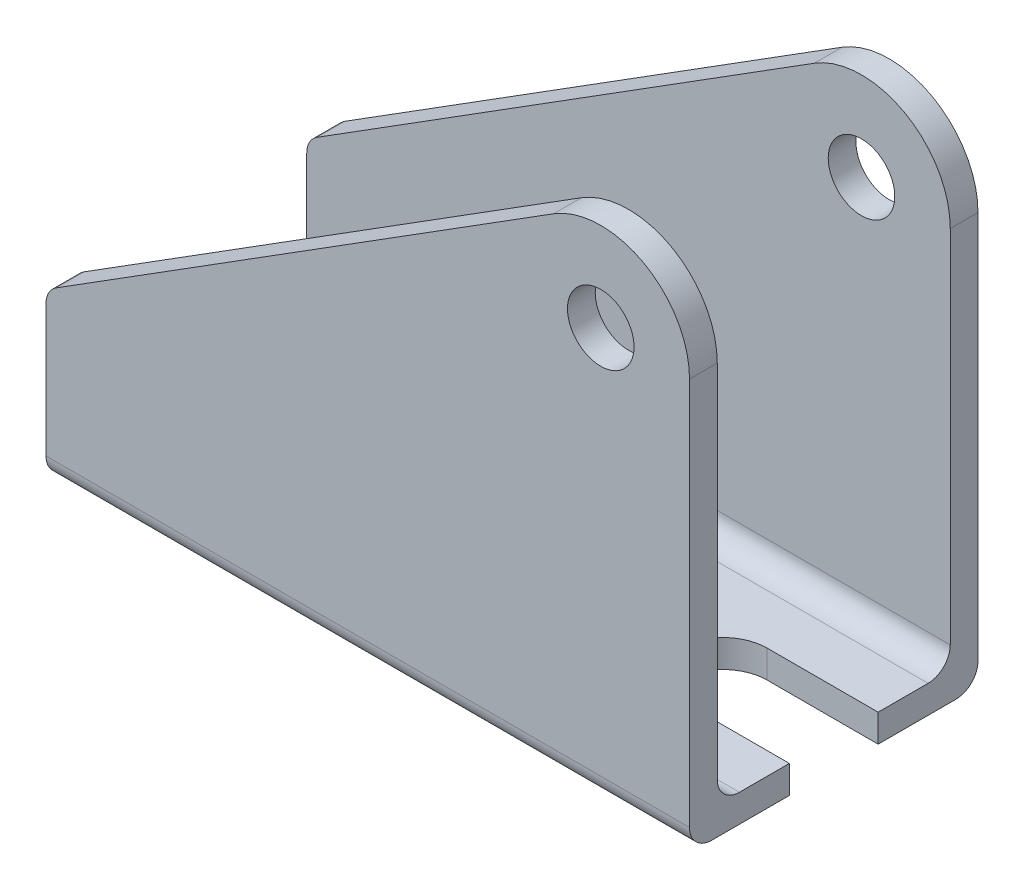
ISO-10303-21;
HEADER;
FILE_DESCRIPTION(('STEP AP214'),'2;1');
FILE_NAME('part.step','',(''),(''),'','','');
FILE_SCHEMA(('AUTOMOTIVE_DESIGN { 1 0 10303 214 1 1 1 1 }'));
ENDSEC;
DATA;
#1=APPLICATION_CONTEXT('core data for automotive mechanical design processes');
#2=APPLICATION_PROTOCOL_DEFINITION('international standard','automotive_design',2000,#1);
#3=PRODUCT_CONTEXT('',#1,'mechanical');
#4=PRODUCT('Part','Part','',(#3));
#5=PRODUCT_RELATED_PRODUCT_CATEGORY('part','',(#4));
#6=PRODUCT_DEFINITION_FORMATION('','',#4);
#7=PRODUCT_DEFINITION_CONTEXT('part definition',#1,'design');
#8=PRODUCT_DEFINITION('design','',#6,#7);
#9=PRODUCT_DEFINITION_SHAPE('','',#8);
#10=(LENGTH_UNIT() NAMED_UNIT(*) SI_UNIT(.MILLI.,.METRE.));
#11=(NAMED_UNIT(*) PLANE_ANGLE_UNIT() SI_UNIT($,.RADIAN.));
#12=(NAMED_UNIT(*) SI_UNIT($,.STERADIAN.) SOLID_ANGLE_UNIT());
#13=UNCERTAINTY_MEASURE_WITH_UNIT(LENGTH_MEASURE(1.E-05),#10,'distance_accuracy_value','');
#14=(GEOMETRIC_REPRESENTATION_CONTEXT(3) GLOBAL_UNCERTAINTY_ASSIGNED_CONTEXT((#13)) GLOBAL_UNIT_ASSIGNED_CONTEXT((#10,
#11,#12)) REPRESENTATION_CONTEXT('',''));
#15=CARTESIAN_POINT('',(0.,0.,0.));
#16=DIRECTION('',(0.,0.,1.));
#17=DIRECTION('',(1.,0.,0.));
#18=AXIS2_PLACEMENT_3D('',#15,#16,#17);
#19=CARTESIAN_POINT('',(37.3748426105827,-9.78031656853013,26.));
#20=DIRECTION('',(-1.,0.,0.));
#21=DIRECTION('',(0.,0.,1.));
#22=AXIS2_PLACEMENT_3D('',#19,#20,#21);
#23=PLANE('',#22);
#24=DIRECTION('',(0.,0.,-1.));
#25=VECTOR('',#24,1.);
#26=CARTESIAN_POINT('',(37.3748426105827,-9.78031656853013,26.));
#27=LINE('',#26,#25);
#28=CARTESIAN_POINT('',(37.3748426105827,-9.78031656853013,24.));
#29=VERTEX_POINT('',#28);
#30=CARTESIAN_POINT('',(37.3748426105827,-9.78031656853013,17.));
#31=VERTEX_POINT('',#30);
#32=EDGE_CURVE('E206',#29,#31,#27,.T.);
#33=ORIENTED_EDGE('',*,*,#32,.T.);
#34=DIRECTION('',(0.,1.,0.));
#35=VECTOR('',#34,1.);
#36=CARTESIAN_POINT('',(37.3748426105827,-9.78031656853013,17.));
#37=LINE('',#36,#35);
#38=CARTESIAN_POINT('',(37.3748426105827,-7.28031656853013,17.));
#39=VERTEX_POINT('',#38);
#40=EDGE_CURVE('E317',#31,#39,#37,.T.);
#41=ORIENTED_EDGE('',*,*,#40,.T.);
#42=DIRECTION('',(0.,0.,-1.));
#43=VECTOR('',#42,1.);
#44=CARTESIAN_POINT('',(37.3748426105827,-7.28031656853013,26.));
#45=LINE('',#44,#43);
#46=CARTESIAN_POINT('',(37.3748426105827,-7.28031656853013,21.5));
#47=VERTEX_POINT('',#46);
#48=EDGE_CURVE('E323',#47,#39,#45,.T.);
#49=ORIENTED_EDGE('',*,*,#48,.F.);
#50=CARTESIAN_POINT('',(37.3748426105827,-5.28031656853013,21.5));
#51=DIRECTION('',(-1.,0.,0.));
#52=DIRECTION('',(0.,0.,1.));
#53=AXIS2_PLACEMENT_3D('',#50,#51,#52);
#54=CIRCLE('',#53,2.);
#55=CARTESIAN_POINT('',(37.3748426105827,-5.28031656853014,23.5));
#56=VERTEX_POINT('',#55);
#57=EDGE_CURVE('E283',#47,#56,#54,.T.);
#58=ORIENTED_EDGE('',*,*,#57,.T.);
#59=DIRECTION('',(0.,1.,0.));
#60=VECTOR('',#59,1.);
#61=CARTESIAN_POINT('',(37.3748426105827,27.2196834314699,23.5));
#62=LINE('',#61,#60);
#63=CARTESIAN_POINT('',(37.3748426105827,27.2196834314699,23.5));
#64=VERTEX_POINT('',#63);
#65=EDGE_CURVE('E338',#56,#64,#62,.T.);
#66=ORIENTED_EDGE('',*,*,#65,.T.);
#67=DIRECTION('',(0.,0.,-1.));
#68=VECTOR('',#67,1.);
#69=CARTESIAN_POINT('',(37.3748426105827,27.2196834314699,26.));
#70=LINE('',#69,#68);
#71=CARTESIAN_POINT('',(37.3748426105827,27.2196834314699,26.));
#72=VERTEX_POINT('',#71);
#73=EDGE_CURVE('E207',#72,#64,#70,.T.);
#74=ORIENTED_EDGE('',*,*,#73,.F.);
#75=DIRECTION('',(0.,1.,0.));
#76=VECTOR('',#75,1.);
#77=CARTESIAN_POINT('',(37.3748426105827,-9.78031656853013,26.));
#78=LINE('',#77,#76);
#79=CARTESIAN_POINT('',(37.3748426105827,-7.78031656853013,26.));
#80=VERTEX_POINT('',#79);
#81=EDGE_CURVE('E373',#80,#72,#78,.T.);
#82=ORIENTED_EDGE('',*,*,#81,.F.);
#83=CARTESIAN_POINT('',(37.3748426105827,-7.78031656853013,24.));
#84=DIRECTION('',(-1.,0.,0.));
#85=DIRECTION('',(0.,0.,1.));
#86=AXIS2_PLACEMENT_3D('',#83,#84,#85);
#87=CIRCLE('',#86,2.);
#88=EDGE_CURVE('E230',#80,#29,#87,.F.);
#89=ORIENTED_EDGE('',*,*,#88,.T.);
#90=EDGE_LOOP('',(#33,#41,#49,#58,#66,#74,#82,#89));
#91=FACE_BOUND('',#90,.T.);
#92=ADVANCED_FACE('F42',(#91),#23,.F.);
#93=CARTESIAN_POINT('',(-20.6251573894173,5.21968343146987,26.));
#94=DIRECTION('',(1.,0.,0.));
#95=DIRECTION('',(0.,1.,0.));
#96=AXIS2_PLACEMENT_3D('',#93,#94,#95);
#97=PLANE('',#96);
#98=DIRECTION('',(0.,0.,-1.));
#99=VECTOR('',#98,1.);
#100=CARTESIAN_POINT('',(-20.6251573894173,-9.78031656853013,26.));
#101=LINE('',#100,#99);
#102=CARTESIAN_POINT('',(-20.6251573894173,-9.78031656853013,24.));
#103=VERTEX_POINT('',#102);
#104=CARTESIAN_POINT('',(-20.6251573894173,-9.78031656853013,2.00000000000001));
#105=VERTEX_POINT('',#104);
#106=EDGE_CURVE('E212',#103,#105,#101,.T.);
#107=ORIENTED_EDGE('',*,*,#106,.F.);
#108=CARTESIAN_POINT('',(-20.6251573894173,-7.78031656853013,24.));
#109=DIRECTION('',(1.,0.,0.));
#110=DIRECTION('',(0.,1.,0.));
#111=AXIS2_PLACEMENT_3D('',#108,#109,#110);
#112=CIRCLE('',#111,2.);
#113=CARTESIAN_POINT('',(-20.6251573894173,-7.78031656853013,26.));
#114=VERTEX_POINT('',#113);
#115=EDGE_CURVE('E249',#103,#114,#112,.F.);
#116=ORIENTED_EDGE('',*,*,#115,.T.);
#117=DIRECTION('',(0.,-1.,0.));
#118=VECTOR('',#117,1.);
#119=CARTESIAN_POINT('',(-20.6251573894173,5.21968343146987,26.));
#120=LINE('',#119,#118);
#121=CARTESIAN_POINT('',(-20.6251573894173,4.1149584540759,26.));
#122=VERTEX_POINT('',#121);
#123=EDGE_CURVE('E369',#122,#114,#120,.T.);
#124=ORIENTED_EDGE('',*,*,#123,.F.);
#125=DIRECTION('',(0.,0.,-1.));
#126=VECTOR('',#125,1.);
#127=CARTESIAN_POINT('',(-20.6251573894173,4.1149584540759,26.));
#128=LINE('',#127,#126);
#129=CARTESIAN_POINT('',(-20.6251573894173,4.1149584540759,23.5));
#130=VERTEX_POINT('',#129);
#131=EDGE_CURVE('E242',#122,#130,#128,.T.);
#132=ORIENTED_EDGE('',*,*,#131,.T.);
#133=DIRECTION('',(0.,-1.,0.));
#134=VECTOR('',#133,1.);
#135=CARTESIAN_POINT('',(-20.6251573894173,27.2196834314699,23.5));
#136=LINE('',#135,#134);
#137=CARTESIAN_POINT('',(-20.6251573894173,-5.28031656853013,23.5));
#138=VERTEX_POINT('',#137);
#139=EDGE_CURVE('E350',#130,#138,#136,.T.);
#140=ORIENTED_EDGE('',*,*,#139,.T.);
#141=CARTESIAN_POINT('',(-20.6251573894173,-5.28031656853013,21.5));
#142=DIRECTION('',(1.,0.,0.));
#143=DIRECTION('',(0.,1.,0.));
#144=AXIS2_PLACEMENT_3D('',#141,#142,#143);
#145=CIRCLE('',#144,2.);
#146=CARTESIAN_POINT('',(-20.6251573894173,-7.28031656853013,21.5));
#147=VERTEX_POINT('',#146);
#148=EDGE_CURVE('E286',#138,#147,#145,.T.);
#149=ORIENTED_EDGE('',*,*,#148,.T.);
#150=DIRECTION('',(0.,0.,-1.));
#151=VECTOR('',#150,1.);
#152=CARTESIAN_POINT('',(-20.6251573894173,-7.28031656853013,26.));
#153=LINE('',#152,#151);
#154=CARTESIAN_POINT('',(-20.6251573894173,-7.28031656853013,4.5));
#155=VERTEX_POINT('',#154);
#156=EDGE_CURVE('E328',#147,#155,#153,.T.);
#157=ORIENTED_EDGE('',*,*,#156,.T.);
#158=CARTESIAN_POINT('',(-20.6251573894173,-5.28031656853014,4.5));
#159=DIRECTION('',(1.,0.,0.));
#160=DIRECTION('',(0.,1.,0.));
#161=AXIS2_PLACEMENT_3D('',#158,#159,#160);
#162=CIRCLE('',#161,2.);
#163=CARTESIAN_POINT('',(-20.6251573894173,-5.28031656853013,2.5));
#164=VERTEX_POINT('',#163);
#165=EDGE_CURVE('E292',#155,#164,#162,.T.);
#166=ORIENTED_EDGE('',*,*,#165,.T.);
#167=DIRECTION('',(0.,-1.,0.));
#168=VECTOR('',#167,1.);
#169=CARTESIAN_POINT('',(-20.6251573894173,27.2196834314699,2.5));
#170=LINE('',#169,#168);
#171=CARTESIAN_POINT('',(-20.6251573894173,4.1149584540759,2.5));
#172=VERTEX_POINT('',#171);
#173=EDGE_CURVE('E344',#172,#164,#170,.T.);
#174=ORIENTED_EDGE('',*,*,#173,.F.);
#175=DIRECTION('',(0.,0.,-1.));
#176=VECTOR('',#175,1.);
#177=CARTESIAN_POINT('',(-20.6251573894173,4.1149584540759,26.));
#178=LINE('',#177,#176);
#179=CARTESIAN_POINT('',(-20.6251573894173,4.1149584540759,0.));
#180=VERTEX_POINT('',#179);
#181=EDGE_CURVE('E238',#172,#180,#178,.T.);
#182=ORIENTED_EDGE('',*,*,#181,.T.);
#183=DIRECTION('',(0.,-1.,0.));
#184=VECTOR('',#183,1.);
#185=CARTESIAN_POINT('',(-20.6251573894173,5.21968343146987,0.));
#186=LINE('',#185,#184);
#187=CARTESIAN_POINT('',(-20.6251573894173,-7.78031656853013,0.));
#188=VERTEX_POINT('',#187);
#189=EDGE_CURVE('E365',#180,#188,#186,.T.);
#190=ORIENTED_EDGE('',*,*,#189,.T.);
#191=CARTESIAN_POINT('',(-20.6251573894173,-7.78031656853013,2.));
#192=DIRECTION('',(1.,0.,0.));
#193=DIRECTION('',(0.,1.,0.));
#194=AXIS2_PLACEMENT_3D('',#191,#192,#193);
#195=CIRCLE('',#194,2.);
#196=EDGE_CURVE('E246',#188,#105,#195,.F.);
#197=ORIENTED_EDGE('',*,*,#196,.T.);
#198=EDGE_LOOP('',(#107,#116,#124,#132,#140,#149,#157,#166,#174,#182,#190,#197));
#199=FACE_BOUND('',#198,.T.);
#200=ADVANCED_FACE('F426',(#199),#97,.F.);
#201=CARTESIAN_POINT('',(37.3748426105827,-7.28031656853013,8.99999999999999));
#202=VERTEX_POINT('',#201);
#203=CARTESIAN_POINT('',(37.3748426105827,-7.28031656853013,4.5));
#204=VERTEX_POINT('',#203);
#205=EDGE_CURVE('E196',#202,#204,#45,.T.);
#206=ORIENTED_EDGE('',*,*,#205,.F.);
#207=DIRECTION('',(0.,1.,0.));
#208=VECTOR('',#207,1.);
#209=CARTESIAN_POINT('',(37.3748426105827,-9.78031656853013,8.99999999999999));
#210=LINE('',#209,#208);
#211=CARTESIAN_POINT('',(37.3748426105827,-9.78031656853013,8.99999999999999));
#212=VERTEX_POINT('',#211);
#213=EDGE_CURVE('E58',#212,#202,#210,.T.);
#214=ORIENTED_EDGE('',*,*,#213,.F.);
#215=CARTESIAN_POINT('',(37.3748426105827,-9.78031656853013,2.00000000000001));
#216=VERTEX_POINT('',#215);
#217=EDGE_CURVE('E193',#212,#216,#27,.T.);
#218=ORIENTED_EDGE('',*,*,#217,.T.);
#219=CARTESIAN_POINT('',(37.3748426105827,-7.78031656853013,2.));
#220=DIRECTION('',(-1.,0.,0.));
#221=DIRECTION('',(0.,0.,1.));
#222=AXIS2_PLACEMENT_3D('',#219,#220,#221);
#223=CIRCLE('',#222,2.);
#224=CARTESIAN_POINT('',(37.3748426105827,-7.78031656853013,0.));
#225=VERTEX_POINT('',#224);
#226=EDGE_CURVE('E227',#216,#225,#223,.F.);
#227=ORIENTED_EDGE('',*,*,#226,.T.);
#228=DIRECTION('',(0.,1.,0.));
#229=VECTOR('',#228,1.);
#230=CARTESIAN_POINT('',(37.3748426105827,-9.78031656853013,0.));
#231=LINE('',#230,#229);
#232=CARTESIAN_POINT('',(37.3748426105827,27.2196834314699,0.));
#233=VERTEX_POINT('',#232);
#234=EDGE_CURVE('E388',#225,#233,#231,.T.);
#235=ORIENTED_EDGE('',*,*,#234,.T.);
#236=CARTESIAN_POINT('',(37.3748426105827,27.2196834314699,2.5));
#237=VERTEX_POINT('',#236);
#238=EDGE_CURVE('E214',#237,#233,#70,.T.);
#239=ORIENTED_EDGE('',*,*,#238,.F.);
#240=DIRECTION('',(0.,1.,0.));
#241=VECTOR('',#240,1.);
#242=CARTESIAN_POINT('',(37.3748426105827,27.2196834314699,2.5));
#243=LINE('',#242,#241);
#244=CARTESIAN_POINT('',(37.3748426105827,-5.28031656853014,2.5));
#245=VERTEX_POINT('',#244);
#246=EDGE_CURVE('E340',#245,#237,#243,.T.);
#247=ORIENTED_EDGE('',*,*,#246,.F.);
#248=CARTESIAN_POINT('',(37.3748426105827,-5.28031656853014,4.5));
#249=DIRECTION('',(-1.,0.,0.));
#250=DIRECTION('',(0.,0.,1.));
#251=AXIS2_PLACEMENT_3D('',#248,#249,#250);
#252=CIRCLE('',#251,2.);
#253=EDGE_CURVE('E289',#245,#204,#252,.T.);
#254=ORIENTED_EDGE('',*,*,#253,.T.);
#255=EDGE_LOOP('',(#206,#214,#218,#227,#235,#239,#247,#254));
#256=FACE_BOUND('',#255,.T.);
#257=ADVANCED_FACE('F192',(#256),#23,.F.);
#258=CARTESIAN_POINT('',(29.3748426105827,27.2196834314699,26.));
#259=DIRECTION('',(0.,0.,-1.));
#260=DIRECTION('',(-1.,0.,0.));
#261=AXIS2_PLACEMENT_3D('',#258,#259,#260);
#262=CYLINDRICAL_SURFACE('',#261,8.);
#263=CARTESIAN_POINT('',(29.3748426105827,27.2196834314699,2.5));
#264=DIRECTION('',(0.,0.,-1.));
#265=DIRECTION('',(-1.,0.,0.));
#266=AXIS2_PLACEMENT_3D('',#263,#264,#265);
#267=CIRCLE('',#266,8.);
#268=CARTESIAN_POINT('',(25.115286214933,33.991402512492,2.5));
#269=VERTEX_POINT('',#268);
#270=EDGE_CURVE('E343',#237,#269,#267,.F.);
#271=ORIENTED_EDGE('',*,*,#270,.F.);
#272=ORIENTED_EDGE('',*,*,#238,.T.);
#273=CARTESIAN_POINT('',(29.3748426105827,27.2196834314699,0.));
#274=DIRECTION('',(0.,0.,1.));
#275=DIRECTION('',(-1.,0.,0.));
#276=AXIS2_PLACEMENT_3D('',#273,#274,#275);
#277=CIRCLE('',#276,8.);
#278=CARTESIAN_POINT('',(25.115286214933,33.991402512492,0.));
#279=VERTEX_POINT('',#278);
#280=EDGE_CURVE('E391',#233,#279,#277,.T.);
#281=ORIENTED_EDGE('',*,*,#280,.T.);
#282=DIRECTION('',(0.,0.,-1.));
#283=VECTOR('',#282,1.);
#284=CARTESIAN_POINT('',(25.115286214933,33.991402512492,26.));
#285=LINE('',#284,#283);
#286=EDGE_CURVE('E384',#269,#279,#285,.T.);
#287=ORIENTED_EDGE('',*,*,#286,.F.);
#288=EDGE_LOOP('',(#271,#272,#281,#287));
#289=FACE_BOUND('',#288,.T.);
#290=ADVANCED_FACE('F412',(#289),#262,.T.);
#291=CARTESIAN_POINT('',(25.115286214933,33.991402512492,26.));
#292=DIRECTION('',(0.532444549456218,-0.846464885127768,0.));
#293=DIRECTION('',(0.846464885127768,0.532444549456218,0.));
#294=AXIS2_PLACEMENT_3D('',#291,#292,#293);
#295=PLANE('',#294);
#296=DIRECTION('',(-0.846464885127768,-0.532444549456218,0.));
#297=VECTOR('',#296,1.);
#298=CARTESIAN_POINT('',(25.115286214933,33.991402512492,0.));
#299=LINE('',#298,#297);
#300=CARTESIAN_POINT('',(-19.6900464883297,5.80788822433143,0.));
#301=VERTEX_POINT('',#300);
#302=EDGE_CURVE('E374',#279,#301,#299,.T.);
#303=ORIENTED_EDGE('',*,*,#302,.T.);
#304=DIRECTION('',(0.,0.,-1.));
#305=VECTOR('',#304,1.);
#306=CARTESIAN_POINT('',(-19.6900464883297,5.80788822433143,26.));
#307=LINE('',#306,#305);
#308=CARTESIAN_POINT('',(-19.6900464883297,5.80788822433143,2.5));
#309=VERTEX_POINT('',#308);
#310=EDGE_CURVE('E66',#301,#309,#307,.F.);
#311=ORIENTED_EDGE('',*,*,#310,.T.);
#312=DIRECTION('',(-0.846464885127768,-0.532444549456218,0.));
#313=VECTOR('',#312,1.);
#314=CARTESIAN_POINT('',(25.115286214933,33.991402512492,2.5));
#315=LINE('',#314,#313);
#316=EDGE_CURVE('E347',#269,#309,#315,.T.);
#317=ORIENTED_EDGE('',*,*,#316,.F.);
#318=ORIENTED_EDGE('',*,*,#286,.T.);
#319=EDGE_LOOP('',(#303,#311,#317,#318));
#320=FACE_BOUND('',#319,.T.);
#321=ADVANCED_FACE('F407',(#320),#295,.F.);
#322=CARTESIAN_POINT('',(29.3748426105827,27.2196834314699,26.));
#323=DIRECTION('',(0.,0.,-1.));
#324=DIRECTION('',(-1.,0.,0.));
#325=AXIS2_PLACEMENT_3D('',#322,#323,#324);
#326=CYLINDRICAL_SURFACE('',#325,3.);
#327=CARTESIAN_POINT('',(29.3748426105827,27.2196834314699,0.));
#328=DIRECTION('',(0.,0.,1.));
#329=DIRECTION('',(1.,0.,0.));
#330=AXIS2_PLACEMENT_3D('',#327,#328,#329);
#331=CIRCLE('',#330,3.);
#332=CARTESIAN_POINT('',(32.3748426105827,27.2196834314699,0.));
#333=VERTEX_POINT('',#332);
#334=EDGE_CURVE('E333',#333,#333,#331,.T.);
#335=ORIENTED_EDGE('',*,*,#334,.F.);
#336=EDGE_LOOP('',(#335));
#337=FACE_BOUND('',#336,.T.);
#338=CARTESIAN_POINT('',(29.3748426105827,27.2196834314699,2.5));
#339=DIRECTION('',(0.,0.,-1.));
#340=DIRECTION('',(-1.,0.,0.));
#341=AXIS2_PLACEMENT_3D('',#338,#339,#340);
#342=CIRCLE('',#341,3.);
#343=CARTESIAN_POINT('',(26.3748426105827,27.2196834314699,2.5));
#344=VERTEX_POINT('',#343);
#345=EDGE_CURVE('E300',#344,#344,#342,.F.);
#346=ORIENTED_EDGE('',*,*,#345,.T.);
#347=EDGE_LOOP('',(#346));
#348=FACE_BOUND('',#347,.T.);
#349=ADVANCED_FACE('F487',(#337,#348),#326,.F.);
#350=CARTESIAN_POINT('',(29.3748426105827,27.2196834314699,26.));
#351=DIRECTION('',(0.,0.,-1.));
#352=DIRECTION('',(-1.,0.,0.));
#353=AXIS2_PLACEMENT_3D('',#350,#351,#352);
#354=PLANE('',#353);
#355=ORIENTED_EDGE('',*,*,#123,.T.);
#356=DIRECTION('',(1.,0.,0.));
#357=VECTOR('',#356,1.);
#358=CARTESIAN_POINT('',(29.3748426105827,-7.78031656853013,26.));
#359=LINE('',#358,#357);
#360=EDGE_CURVE('E223',#114,#80,#359,.T.);
#361=ORIENTED_EDGE('',*,*,#360,.T.);
#362=ORIENTED_EDGE('',*,*,#81,.T.);
#363=CARTESIAN_POINT('',(29.3748426105827,27.2196834314699,26.));
#364=DIRECTION('',(0.,0.,1.));
#365=DIRECTION('',(-1.,0.,0.));
#366=AXIS2_PLACEMENT_3D('',#363,#364,#365);
#367=CIRCLE('',#366,8.);
#368=CARTESIAN_POINT('',(25.115286214933,33.991402512492,26.));
#369=VERTEX_POINT('',#368);
#370=EDGE_CURVE('E377',#72,#369,#367,.T.);
#371=ORIENTED_EDGE('',*,*,#370,.T.);
#372=DIRECTION('',(-0.846464885127768,-0.532444549456218,0.));
#373=VECTOR('',#372,1.);
#374=CARTESIAN_POINT('',(25.115286214933,33.991402512492,26.));
#375=LINE('',#374,#373);
#376=CARTESIAN_POINT('',(-19.6900464883297,5.80788822433143,26.));
#377=VERTEX_POINT('',#376);
#378=EDGE_CURVE('E380',#369,#377,#375,.T.);
#379=ORIENTED_EDGE('',*,*,#378,.T.);
#380=CARTESIAN_POINT('',(-18.6251573894173,4.1149584540759,26.));
#381=DIRECTION('',(0.,0.,-1.));
#382=DIRECTION('',(-1.,0.,0.));
#383=AXIS2_PLACEMENT_3D('',#380,#381,#382);
#384=CIRCLE('',#383,2.);
#385=EDGE_CURVE('E220',#377,#122,#384,.F.);
#386=ORIENTED_EDGE('',*,*,#385,.T.);
#387=EDGE_LOOP('',(#355,#361,#362,#371,#379,#386));
#388=FACE_BOUND('',#387,.T.);
#389=CARTESIAN_POINT('',(29.3748426105827,27.2196834314699,26.));
#390=DIRECTION('',(0.,0.,1.));
#391=DIRECTION('',(1.,0.,0.));
#392=AXIS2_PLACEMENT_3D('',#389,#390,#391);
#393=CIRCLE('',#392,3.);
#394=CARTESIAN_POINT('',(32.3748426105827,27.2196834314699,26.));
#395=VERTEX_POINT('',#394);
#396=EDGE_CURVE('E361',#395,#395,#393,.T.);
#397=ORIENTED_EDGE('',*,*,#396,.F.);
#398=EDGE_LOOP('',(#397));
#399=FACE_BOUND('',#398,.T.);
#400=ADVANCED_FACE('F448',(#388,#399),#354,.F.);
#401=CARTESIAN_POINT('',(29.3748426105827,27.2196834314699,0.));
#402=DIRECTION('',(0.,0.,-1.));
#403=DIRECTION('',(-1.,0.,0.));
#404=AXIS2_PLACEMENT_3D('',#401,#402,#403);
#405=PLANE('',#404);
#406=ORIENTED_EDGE('',*,*,#234,.F.);
#407=DIRECTION('',(1.,0.,0.));
#408=VECTOR('',#407,1.);
#409=CARTESIAN_POINT('',(-20.6251573894173,-7.78031656853013,0.));
#410=LINE('',#409,#408);
#411=EDGE_CURVE('E255',#225,#188,#410,.F.);
#412=ORIENTED_EDGE('',*,*,#411,.T.);
#413=ORIENTED_EDGE('',*,*,#189,.F.);
#414=CARTESIAN_POINT('',(-18.6251573894173,4.1149584540759,0.));
#415=DIRECTION('',(0.,0.,-1.));
#416=DIRECTION('',(-1.,0.,0.));
#417=AXIS2_PLACEMENT_3D('',#414,#415,#416);
#418=CIRCLE('',#417,2.);
#419=EDGE_CURVE('E252',#180,#301,#418,.T.);
#420=ORIENTED_EDGE('',*,*,#419,.T.);
#421=ORIENTED_EDGE('',*,*,#302,.F.);
#422=ORIENTED_EDGE('',*,*,#280,.F.);
#423=EDGE_LOOP('',(#406,#412,#413,#420,#421,#422));
#424=FACE_BOUND('',#423,.T.);
#425=ORIENTED_EDGE('',*,*,#334,.T.);
#426=EDGE_LOOP('',(#425));
#427=FACE_BOUND('',#426,.T.);
#428=ADVANCED_FACE('F416',(#424,#427),#405,.T.);
#429=CARTESIAN_POINT('',(-20.6251573894173,-9.78031656853013,26.));
#430=DIRECTION('',(0.,1.,0.));
#431=DIRECTION('',(0.,0.,1.));
#432=AXIS2_PLACEMENT_3D('',#429,#430,#431);
#433=PLANE('',#432);
#434=CARTESIAN_POINT('',(-8.62515738941729,-9.78031656853013,13.));
#435=DIRECTION('',(0.,1.,0.));
#436=DIRECTION('',(0.,0.,1.));
#437=AXIS2_PLACEMENT_3D('',#434,#435,#436);
#438=CIRCLE('',#437,4.);
#439=CARTESIAN_POINT('',(-8.62515738941729,-9.78031656853013,17.));
#440=VERTEX_POINT('',#439);
#441=EDGE_CURVE('E301',#440,#440,#438,.T.);
#442=ORIENTED_EDGE('',*,*,#441,.T.);
#443=EDGE_LOOP('',(#442));
#444=FACE_BOUND('',#443,.T.);
#445=CARTESIAN_POINT('',(27.3748426105827,-9.78031656853013,13.));
#446=DIRECTION('',(0.,1.,0.));
#447=DIRECTION('',(0.,0.,1.));
#448=AXIS2_PLACEMENT_3D('',#445,#446,#447);
#449=CIRCLE('',#448,4.);
#450=CARTESIAN_POINT('',(27.3748426105827,-9.78031656853013,8.99999999999999));
#451=VERTEX_POINT('',#450);
#452=CARTESIAN_POINT('',(27.3748426105827,-9.78031656853013,17.));
#453=VERTEX_POINT('',#452);
#454=EDGE_CURVE('E188',#451,#453,#449,.T.);
#455=ORIENTED_EDGE('',*,*,#454,.T.);
#456=DIRECTION('',(1.,0.,0.));
#457=VECTOR('',#456,1.);
#458=CARTESIAN_POINT('',(27.3748426105827,-9.78031656853013,17.));
#459=LINE('',#458,#457);
#460=EDGE_CURVE('E198',#453,#31,#459,.T.);
#461=ORIENTED_EDGE('',*,*,#460,.T.);
#462=ORIENTED_EDGE('',*,*,#32,.F.);
#463=DIRECTION('',(1.,0.,0.));
#464=VECTOR('',#463,1.);
#465=CARTESIAN_POINT('',(-20.6251573894173,-9.78031656853013,24.));
#466=LINE('',#465,#464);
#467=EDGE_CURVE('E235',#29,#103,#466,.F.);
#468=ORIENTED_EDGE('',*,*,#467,.T.);
#469=ORIENTED_EDGE('',*,*,#106,.T.);
#470=DIRECTION('',(1.,0.,0.));
#471=VECTOR('',#470,1.);
#472=CARTESIAN_POINT('',(37.3748426105827,-9.78031656853013,2.));
#473=LINE('',#472,#471);
#474=EDGE_CURVE('E204',#105,#216,#473,.T.);
#475=ORIENTED_EDGE('',*,*,#474,.T.);
#476=ORIENTED_EDGE('',*,*,#217,.F.);
#477=DIRECTION('',(-1.,0.,0.));
#478=VECTOR('',#477,1.);
#479=CARTESIAN_POINT('',(37.3748426105827,-9.78031656853013,8.99999999999999));
#480=LINE('',#479,#478);
#481=EDGE_CURVE('E179',#212,#451,#480,.T.);
#482=ORIENTED_EDGE('',*,*,#481,.T.);
#483=EDGE_LOOP('',(#455,#461,#462,#468,#469,#475,#476,#482));
#484=FACE_BOUND('',#483,.T.);
#485=ADVANCED_FACE('F201',(#444,#484),#433,.F.);
#486=ORIENTED_EDGE('',*,*,#73,.T.);
#487=CARTESIAN_POINT('',(29.3748426105827,27.2196834314699,23.5));
#488=DIRECTION('',(0.,0.,-1.));
#489=DIRECTION('',(-1.,0.,0.));
#490=AXIS2_PLACEMENT_3D('',#487,#488,#489);
#491=CIRCLE('',#490,8.);
#492=CARTESIAN_POINT('',(25.115286214933,33.991402512492,23.5));
#493=VERTEX_POINT('',#492);
#494=EDGE_CURVE('E466',#64,#493,#491,.F.);
#495=ORIENTED_EDGE('',*,*,#494,.T.);
#496=EDGE_CURVE('E396',#369,#493,#285,.T.);
#497=ORIENTED_EDGE('',*,*,#496,.F.);
#498=ORIENTED_EDGE('',*,*,#370,.F.);
#499=EDGE_LOOP('',(#486,#495,#497,#498));
#500=FACE_BOUND('',#499,.T.);
#501=ADVANCED_FACE('F474',(#500),#262,.T.);
#502=DIRECTION('',(-0.846464885127768,-0.532444549456218,0.));
#503=VECTOR('',#502,1.);
#504=CARTESIAN_POINT('',(25.115286214933,33.991402512492,23.5));
#505=LINE('',#504,#503);
#506=CARTESIAN_POINT('',(-19.6900464883297,5.80788822433143,23.5));
#507=VERTEX_POINT('',#506);
#508=EDGE_CURVE('E335',#493,#507,#505,.T.);
#509=ORIENTED_EDGE('',*,*,#508,.T.);
#510=DIRECTION('',(0.,0.,-1.));
#511=VECTOR('',#510,1.);
#512=CARTESIAN_POINT('',(-19.6900464883297,5.80788822433143,26.));
#513=LINE('',#512,#511);
#514=EDGE_CURVE('E264',#507,#377,#513,.F.);
#515=ORIENTED_EDGE('',*,*,#514,.T.);
#516=ORIENTED_EDGE('',*,*,#378,.F.);
#517=ORIENTED_EDGE('',*,*,#496,.T.);
#518=EDGE_LOOP('',(#509,#515,#516,#517));
#519=FACE_BOUND('',#518,.T.);
#520=ADVANCED_FACE('F477',(#519),#295,.F.);
#521=CARTESIAN_POINT('',(29.3748426105827,27.2196834314699,23.5));
#522=DIRECTION('',(0.,0.,-1.));
#523=DIRECTION('',(-1.,0.,0.));
#524=AXIS2_PLACEMENT_3D('',#521,#522,#523);
#525=CIRCLE('',#524,3.);
#526=CARTESIAN_POINT('',(26.3748426105827,27.2196834314699,23.5));
#527=VERTEX_POINT('',#526);
#528=EDGE_CURVE('E353',#527,#527,#525,.F.);
#529=ORIENTED_EDGE('',*,*,#528,.F.);
#530=EDGE_LOOP('',(#529));
#531=FACE_BOUND('',#530,.T.);
#532=ORIENTED_EDGE('',*,*,#396,.T.);
#533=EDGE_LOOP('',(#532));
#534=FACE_BOUND('',#533,.T.);
#535=ADVANCED_FACE('F479',(#531,#534),#326,.F.);
#536=CARTESIAN_POINT('',(29.3748426105827,27.2196834314699,23.5));
#537=DIRECTION('',(0.,0.,-1.));
#538=DIRECTION('',(-1.,0.,0.));
#539=AXIS2_PLACEMENT_3D('',#536,#537,#538);
#540=PLANE('',#539);
#541=ORIENTED_EDGE('',*,*,#139,.F.);
#542=CARTESIAN_POINT('',(-18.6251573894173,4.1149584540759,23.5));
#543=DIRECTION('',(0.,0.,-1.));
#544=DIRECTION('',(-1.,0.,0.));
#545=AXIS2_PLACEMENT_3D('',#542,#543,#544);
#546=CIRCLE('',#545,2.);
#547=EDGE_CURVE('E261',#130,#507,#546,.T.);
#548=ORIENTED_EDGE('',*,*,#547,.T.);
#549=ORIENTED_EDGE('',*,*,#508,.F.);
#550=ORIENTED_EDGE('',*,*,#494,.F.);
#551=ORIENTED_EDGE('',*,*,#65,.F.);
#552=DIRECTION('',(1.,0.,0.));
#553=VECTOR('',#552,1.);
#554=CARTESIAN_POINT('',(-20.6251573894173,-5.28031656853013,23.5));
#555=LINE('',#554,#553);
#556=EDGE_CURVE('E258',#56,#138,#555,.F.);
#557=ORIENTED_EDGE('',*,*,#556,.T.);
#558=EDGE_LOOP('',(#541,#548,#549,#550,#551,#557));
#559=FACE_BOUND('',#558,.T.);
#560=ORIENTED_EDGE('',*,*,#528,.T.);
#561=EDGE_LOOP('',(#560));
#562=FACE_BOUND('',#561,.T.);
#563=ADVANCED_FACE('F459',(#559,#562),#540,.T.);
#564=CARTESIAN_POINT('',(29.3748426105827,27.2196834314699,2.5));
#565=DIRECTION('',(0.,0.,-1.));
#566=DIRECTION('',(-1.,0.,0.));
#567=AXIS2_PLACEMENT_3D('',#564,#565,#566);
#568=PLANE('',#567);
#569=ORIENTED_EDGE('',*,*,#316,.T.);
#570=CARTESIAN_POINT('',(-18.6251573894173,4.1149584540759,2.5));
#571=DIRECTION('',(0.,0.,-1.));
#572=DIRECTION('',(-1.,0.,0.));
#573=AXIS2_PLACEMENT_3D('',#570,#571,#572);
#574=CIRCLE('',#573,2.);
#575=EDGE_CURVE('E273',#309,#172,#574,.F.);
#576=ORIENTED_EDGE('',*,*,#575,.T.);
#577=ORIENTED_EDGE('',*,*,#173,.T.);
#578=DIRECTION('',(1.,0.,0.));
#579=VECTOR('',#578,1.);
#580=CARTESIAN_POINT('',(29.3748426105827,-5.28031656853014,2.5));
#581=LINE('',#580,#579);
#582=EDGE_CURVE('E269',#164,#245,#581,.T.);
#583=ORIENTED_EDGE('',*,*,#582,.T.);
#584=ORIENTED_EDGE('',*,*,#246,.T.);
#585=ORIENTED_EDGE('',*,*,#270,.T.);
#586=EDGE_LOOP('',(#569,#576,#577,#583,#584,#585));
#587=FACE_BOUND('',#586,.T.);
#588=ORIENTED_EDGE('',*,*,#345,.F.);
#589=EDGE_LOOP('',(#588));
#590=FACE_BOUND('',#589,.T.);
#591=ADVANCED_FACE('F431',(#587,#590),#568,.F.);
#592=CARTESIAN_POINT('',(-20.6251573894173,-7.28031656853013,26.));
#593=DIRECTION('',(0.,1.,0.));
#594=DIRECTION('',(0.,0.,1.));
#595=AXIS2_PLACEMENT_3D('',#592,#593,#594);
#596=PLANE('',#595);
#597=DIRECTION('',(1.,0.,0.));
#598=VECTOR('',#597,1.);
#599=CARTESIAN_POINT('',(-20.6251573894173,-7.28031656853013,17.));
#600=LINE('',#599,#598);
#601=CARTESIAN_POINT('',(27.3748426105827,-7.28031656853013,17.));
#602=VERTEX_POINT('',#601);
#603=EDGE_CURVE('E11',#602,#39,#600,.T.);
#604=ORIENTED_EDGE('',*,*,#603,.F.);
#605=CARTESIAN_POINT('',(27.3748426105827,-7.28031656853013,13.));
#606=DIRECTION('',(0.,1.,0.));
#607=DIRECTION('',(0.,0.,1.));
#608=AXIS2_PLACEMENT_3D('',#605,#606,#607);
#609=CIRCLE('',#608,4.);
#610=CARTESIAN_POINT('',(27.3748426105827,-7.28031656853013,8.99999999999999));
#611=VERTEX_POINT('',#610);
#612=EDGE_CURVE('E51',#611,#602,#609,.T.);
#613=ORIENTED_EDGE('',*,*,#612,.F.);
#614=DIRECTION('',(-1.,0.,0.));
#615=VECTOR('',#614,1.);
#616=CARTESIAN_POINT('',(-20.6251573894173,-7.28031656853013,8.99999999999999));
#617=LINE('',#616,#615);
#618=EDGE_CURVE('E295',#202,#611,#617,.T.);
#619=ORIENTED_EDGE('',*,*,#618,.F.);
#620=ORIENTED_EDGE('',*,*,#205,.T.);
#621=DIRECTION('',(1.,0.,0.));
#622=VECTOR('',#621,1.);
#623=CARTESIAN_POINT('',(-20.6251573894173,-7.28031656853013,4.5));
#624=LINE('',#623,#622);
#625=EDGE_CURVE('E276',#204,#155,#624,.F.);
#626=ORIENTED_EDGE('',*,*,#625,.T.);
#627=ORIENTED_EDGE('',*,*,#156,.F.);
#628=DIRECTION('',(1.,0.,0.));
#629=VECTOR('',#628,1.);
#630=CARTESIAN_POINT('',(37.3748426105827,-7.28031656853013,21.5));
#631=LINE('',#630,#629);
#632=EDGE_CURVE('E279',#147,#47,#631,.T.);
#633=ORIENTED_EDGE('',*,*,#632,.T.);
#634=ORIENTED_EDGE('',*,*,#48,.T.);
#635=EDGE_LOOP('',(#604,#613,#619,#620,#626,#627,#633,#634));
#636=FACE_BOUND('',#635,.T.);
#637=CARTESIAN_POINT('',(-8.62515738941729,-7.28031656853013,13.));
#638=DIRECTION('',(0.,1.,0.));
#639=DIRECTION('',(0.,0.,1.));
#640=AXIS2_PLACEMENT_3D('',#637,#638,#639);
#641=CIRCLE('',#640,4.);
#642=CARTESIAN_POINT('',(-8.62515738941729,-7.28031656853013,17.));
#643=VERTEX_POINT('',#642);
#644=EDGE_CURVE('E296',#643,#643,#641,.T.);
#645=ORIENTED_EDGE('',*,*,#644,.F.);
#646=EDGE_LOOP('',(#645));
#647=FACE_BOUND('',#646,.T.);
#648=ADVANCED_FACE('F320',(#636,#647),#596,.T.);
#649=CARTESIAN_POINT('',(29.3748426105827,-7.78031656853013,24.));
#650=DIRECTION('',(1.,0.,0.));
#651=DIRECTION('',(0.,0.,-1.));
#652=AXIS2_PLACEMENT_3D('',#649,#650,#651);
#653=CYLINDRICAL_SURFACE('',#652,2.);
#654=ORIENTED_EDGE('',*,*,#115,.F.);
#655=ORIENTED_EDGE('',*,*,#467,.F.);
#656=ORIENTED_EDGE('',*,*,#88,.F.);
#657=ORIENTED_EDGE('',*,*,#360,.F.);
#658=EDGE_LOOP('',(#654,#655,#656,#657));
#659=FACE_BOUND('',#658,.T.);
#660=ADVANCED_FACE('F443',(#659),#653,.T.);
#661=CARTESIAN_POINT('',(-20.6251573894173,-7.78031656853013,2.));
#662=DIRECTION('',(-1.,0.,0.));
#663=DIRECTION('',(0.,0.,1.));
#664=AXIS2_PLACEMENT_3D('',#661,#662,#663);
#665=CYLINDRICAL_SURFACE('',#664,2.);
#666=ORIENTED_EDGE('',*,*,#196,.F.);
#667=ORIENTED_EDGE('',*,*,#411,.F.);
#668=ORIENTED_EDGE('',*,*,#226,.F.);
#669=ORIENTED_EDGE('',*,*,#474,.F.);
#670=EDGE_LOOP('',(#666,#667,#668,#669));
#671=FACE_BOUND('',#670,.T.);
#672=ADVANCED_FACE('F438',(#671),#665,.T.);
#673=CARTESIAN_POINT('',(-18.6251573894173,4.1149584540759,26.));
#674=DIRECTION('',(0.,0.,-1.));
#675=DIRECTION('',(-1.,0.,0.));
#676=AXIS2_PLACEMENT_3D('',#673,#674,#675);
#677=CYLINDRICAL_SURFACE('',#676,2.);
#678=ORIENTED_EDGE('',*,*,#385,.F.);
#679=ORIENTED_EDGE('',*,*,#514,.F.);
#680=ORIENTED_EDGE('',*,*,#547,.F.);
#681=ORIENTED_EDGE('',*,*,#131,.F.);
#682=EDGE_LOOP('',(#678,#679,#680,#681));
#683=FACE_BOUND('',#682,.T.);
#684=ADVANCED_FACE('F454',(#683),#677,.T.);
#685=CARTESIAN_POINT('',(-18.6251573894173,4.1149584540759,26.));
#686=DIRECTION('',(0.,0.,-1.));
#687=DIRECTION('',(-1.,0.,0.));
#688=AXIS2_PLACEMENT_3D('',#685,#686,#687);
#689=CYLINDRICAL_SURFACE('',#688,2.);
#690=ORIENTED_EDGE('',*,*,#575,.F.);
#691=ORIENTED_EDGE('',*,*,#310,.F.);
#692=ORIENTED_EDGE('',*,*,#419,.F.);
#693=ORIENTED_EDGE('',*,*,#181,.F.);
#694=EDGE_LOOP('',(#690,#691,#692,#693));
#695=FACE_BOUND('',#694,.T.);
#696=ADVANCED_FACE('F422',(#695),#689,.T.);
#697=CARTESIAN_POINT('',(-20.6251573894173,-5.28031656853013,21.5));
#698=DIRECTION('',(-1.,0.,0.));
#699=DIRECTION('',(0.,0.,1.));
#700=AXIS2_PLACEMENT_3D('',#697,#698,#699);
#701=CYLINDRICAL_SURFACE('',#700,2.);
#702=ORIENTED_EDGE('',*,*,#148,.F.);
#703=ORIENTED_EDGE('',*,*,#556,.F.);
#704=ORIENTED_EDGE('',*,*,#57,.F.);
#705=ORIENTED_EDGE('',*,*,#632,.F.);
#706=EDGE_LOOP('',(#702,#703,#704,#705));
#707=FACE_BOUND('',#706,.T.);
#708=ADVANCED_FACE('F619',(#707),#701,.F.);
#709=CARTESIAN_POINT('',(29.3748426105827,-5.28031656853014,4.5));
#710=DIRECTION('',(1.,0.,0.));
#711=DIRECTION('',(0.,0.,-1.));
#712=AXIS2_PLACEMENT_3D('',#709,#710,#711);
#713=CYLINDRICAL_SURFACE('',#712,2.);
#714=ORIENTED_EDGE('',*,*,#165,.F.);
#715=ORIENTED_EDGE('',*,*,#625,.F.);
#716=ORIENTED_EDGE('',*,*,#253,.F.);
#717=ORIENTED_EDGE('',*,*,#582,.F.);
#718=EDGE_LOOP('',(#714,#715,#716,#717));
#719=FACE_BOUND('',#718,.T.);
#720=ADVANCED_FACE('F44',(#719),#713,.F.);
#721=CARTESIAN_POINT('',(-8.62515738941729,-9.78031656853013,13.));
#722=DIRECTION('',(0.,1.,0.));
#723=DIRECTION('',(0.,0.,1.));
#724=AXIS2_PLACEMENT_3D('',#721,#722,#723);
#725=CYLINDRICAL_SURFACE('',#724,4.);
#726=ORIENTED_EDGE('',*,*,#644,.T.);
#727=EDGE_LOOP('',(#726));
#728=FACE_BOUND('',#727,.T.);
#729=ORIENTED_EDGE('',*,*,#441,.F.);
#730=EDGE_LOOP('',(#729));
#731=FACE_BOUND('',#730,.T.);
#732=ADVANCED_FACE('F636',(#728,#731),#725,.F.);
#733=CARTESIAN_POINT('',(27.3748426105827,-9.78031656853013,17.));
#734=DIRECTION('',(0.,0.,1.));
#735=DIRECTION('',(1.,0.,0.));
#736=AXIS2_PLACEMENT_3D('',#733,#734,#735);
#737=PLANE('',#736);
#738=ORIENTED_EDGE('',*,*,#603,.T.);
#739=ORIENTED_EDGE('',*,*,#40,.F.);
#740=ORIENTED_EDGE('',*,*,#460,.F.);
#741=DIRECTION('',(0.,1.,0.));
#742=VECTOR('',#741,1.);
#743=CARTESIAN_POINT('',(27.3748426105827,-9.78031656853013,17.));
#744=LINE('',#743,#742);
#745=EDGE_CURVE('E308',#453,#602,#744,.T.);
#746=ORIENTED_EDGE('',*,*,#745,.T.);
#747=EDGE_LOOP('',(#738,#739,#740,#746));
#748=FACE_BOUND('',#747,.T.);
#749=ADVANCED_FACE('F313',(#748),#737,.F.);
#750=CARTESIAN_POINT('',(27.3748426105827,-9.78031656853013,13.));
#751=DIRECTION('',(0.,1.,0.));
#752=DIRECTION('',(0.,0.,1.));
#753=AXIS2_PLACEMENT_3D('',#750,#751,#752);
#754=CYLINDRICAL_SURFACE('',#753,4.);
#755=ORIENTED_EDGE('',*,*,#612,.T.);
#756=ORIENTED_EDGE('',*,*,#745,.F.);
#757=ORIENTED_EDGE('',*,*,#454,.F.);
#758=DIRECTION('',(0.,1.,0.));
#759=VECTOR('',#758,1.);
#760=CARTESIAN_POINT('',(27.3748426105827,-9.78031656853013,8.99999999999999));
#761=LINE('',#760,#759);
#762=EDGE_CURVE('E182',#451,#611,#761,.T.);
#763=ORIENTED_EDGE('',*,*,#762,.T.);
#764=EDGE_LOOP('',(#755,#756,#757,#763));
#765=FACE_BOUND('',#764,.T.);
#766=ADVANCED_FACE('F307',(#765),#754,.F.);
#767=CARTESIAN_POINT('',(37.3748426105827,-9.78031656853013,8.99999999999999));
#768=DIRECTION('',(0.,0.,-1.));
#769=DIRECTION('',(-1.,0.,0.));
#770=AXIS2_PLACEMENT_3D('',#767,#768,#769);
#771=PLANE('',#770);
#772=ORIENTED_EDGE('',*,*,#618,.T.);
#773=ORIENTED_EDGE('',*,*,#762,.F.);
#774=ORIENTED_EDGE('',*,*,#481,.F.);
#775=ORIENTED_EDGE('',*,*,#213,.T.);
#776=EDGE_LOOP('',(#772,#773,#774,#775));
#777=FACE_BOUND('',#776,.T.);
#778=ADVANCED_FACE('F180',(#777),#771,.F.);
#779=CLOSED_SHELL('',(#92,#200,#257,#290,#321,#349,#400,#428,#485,#501,#520,#535,#563,#591,#648,
#660,#672,#684,#696,#708,#720,#732,#749,#766,#778));
#780=MANIFOLD_SOLID_BREP('B2',#779);
#781=ADVANCED_BREP_SHAPE_REPRESENTATION('',(#18,#780),#14);
#782=SHAPE_DEFINITION_REPRESENTATION(#9,#781);
ENDSEC;
END-ISO-10303-21;
